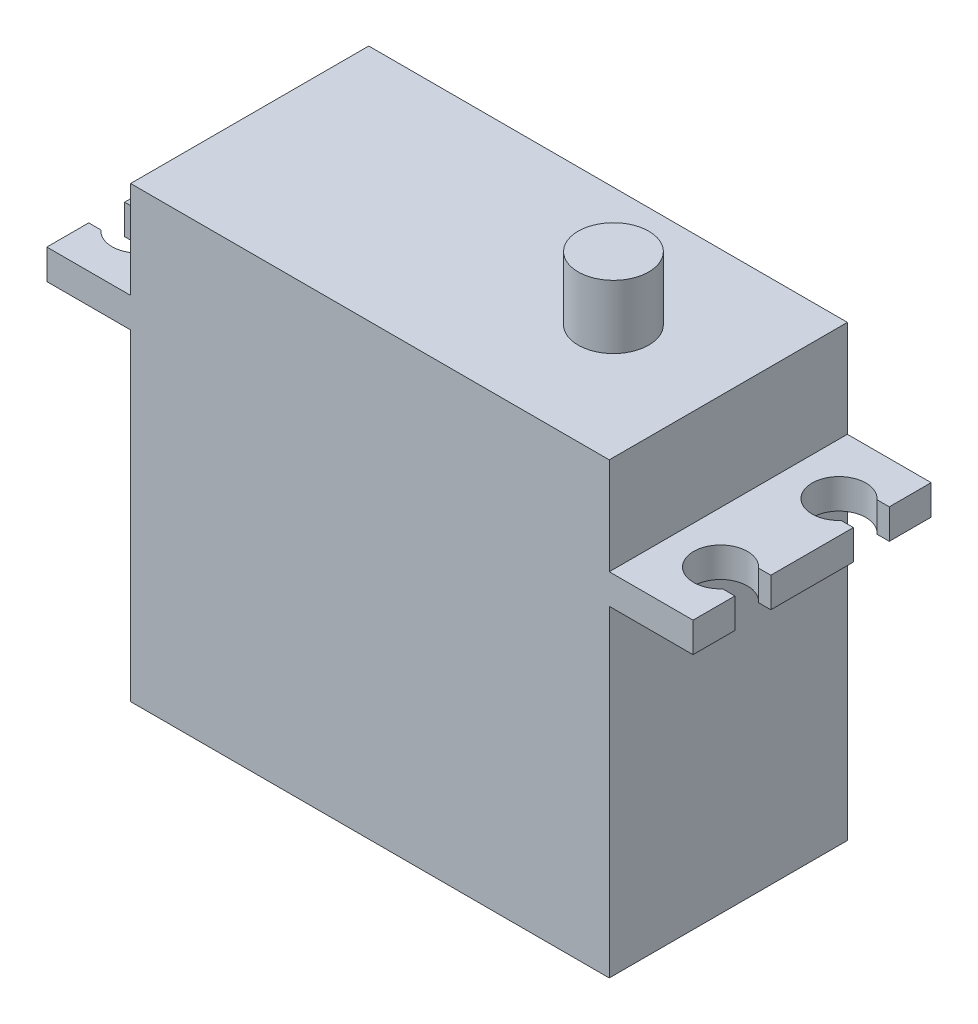
ISO-10303-21;
HEADER;
FILE_DESCRIPTION(('STEP AP214'),'2;1');
FILE_NAME('part.step','',(''),(''),'','','');
FILE_SCHEMA(('AUTOMOTIVE_DESIGN { 1 0 10303 214 1 1 1 1 }'));
ENDSEC;
DATA;
#1=APPLICATION_CONTEXT('core data for automotive mechanical design processes');
#2=APPLICATION_PROTOCOL_DEFINITION('international standard','automotive_design',2000,#1);
#3=PRODUCT_CONTEXT('',#1,'mechanical');
#4=PRODUCT('Part','Part','',(#3));
#5=PRODUCT_RELATED_PRODUCT_CATEGORY('part','',(#4));
#6=PRODUCT_DEFINITION_FORMATION('','',#4);
#7=PRODUCT_DEFINITION_CONTEXT('part definition',#1,'design');
#8=PRODUCT_DEFINITION('design','',#6,#7);
#9=PRODUCT_DEFINITION_SHAPE('','',#8);
#10=(LENGTH_UNIT() NAMED_UNIT(*) SI_UNIT(.MILLI.,.METRE.));
#11=(NAMED_UNIT(*) PLANE_ANGLE_UNIT() SI_UNIT($,.RADIAN.));
#12=(NAMED_UNIT(*) SI_UNIT($,.STERADIAN.) SOLID_ANGLE_UNIT());
#13=UNCERTAINTY_MEASURE_WITH_UNIT(LENGTH_MEASURE(1.E-05),#10,'distance_accuracy_value','');
#14=(GEOMETRIC_REPRESENTATION_CONTEXT(3) GLOBAL_UNCERTAINTY_ASSIGNED_CONTEXT((#13)) GLOBAL_UNIT_ASSIGNED_CONTEXT((#10,
#11,#12)) REPRESENTATION_CONTEXT('',''));
#15=CARTESIAN_POINT('',(0.,0.,0.));
#16=DIRECTION('',(0.,0.,1.));
#17=DIRECTION('',(1.,0.,0.));
#18=AXIS2_PLACEMENT_3D('',#15,#16,#17);
#19=CARTESIAN_POINT('',(10.4,42.8,0.));
#20=DIRECTION('',(0.,-1.,0.));
#21=DIRECTION('',(1.,0.,0.));
#22=AXIS2_PLACEMENT_3D('',#19,#20,#21);
#23=PLANE('',#22);
#24=CARTESIAN_POINT('',(10.4,42.8,0.));
#25=DIRECTION('',(0.,1.,0.));
#26=DIRECTION('',(-1.,0.,0.));
#27=AXIS2_PLACEMENT_3D('',#24,#25,#26);
#28=CIRCLE('',#27,2.95);
#29=CARTESIAN_POINT('',(7.45,42.8,0.));
#30=VERTEX_POINT('',#29);
#31=EDGE_CURVE('E11',#30,#30,#28,.T.);
#32=ORIENTED_EDGE('',*,*,#31,.T.);
#33=EDGE_LOOP('',(#32));
#34=FACE_BOUND('',#33,.T.);
#35=ADVANCED_FACE('F50',(#34),#23,.F.);
#36=CARTESIAN_POINT('',(10.4,42.8,0.));
#37=DIRECTION('',(0.,1.,0.));
#38=DIRECTION('',(-1.,0.,0.));
#39=AXIS2_PLACEMENT_3D('',#36,#37,#38);
#40=CYLINDRICAL_SURFACE('',#39,2.95);
#41=ORIENTED_EDGE('',*,*,#31,.F.);
#42=EDGE_LOOP('',(#41));
#43=FACE_BOUND('',#42,.T.);
#44=CARTESIAN_POINT('',(10.4,25.,0.));
#45=DIRECTION('',(0.,1.,0.));
#46=DIRECTION('',(-1.,0.,0.));
#47=AXIS2_PLACEMENT_3D('',#44,#45,#46);
#48=CIRCLE('',#47,2.95);
#49=CARTESIAN_POINT('',(7.45,25.,0.));
#50=VERTEX_POINT('',#49);
#51=EDGE_CURVE('E56',#50,#50,#48,.T.);
#52=ORIENTED_EDGE('',*,*,#51,.T.);
#53=EDGE_LOOP('',(#52));
#54=FACE_BOUND('',#53,.T.);
#55=ADVANCED_FACE('F82',(#43,#54),#40,.T.);
#56=CARTESIAN_POINT('',(13.35,25.,0.));
#57=DIRECTION('',(0.,-1.,0.));
#58=DIRECTION('',(1.,0.,0.));
#59=AXIS2_PLACEMENT_3D('',#56,#57,#58);
#60=PLANE('',#59);
#61=ORIENTED_EDGE('',*,*,#51,.F.);
#62=EDGE_LOOP('',(#61));
#63=FACE_BOUND('',#62,.T.);
#64=CARTESIAN_POINT('',(10.4,25.,0.));
#65=DIRECTION('',(0.,1.,0.));
#66=DIRECTION('',(-1.,0.,0.));
#67=AXIS2_PLACEMENT_3D('',#64,#65,#66);
#68=CIRCLE('',#67,6.);
#69=CARTESIAN_POINT('',(4.4,25.,0.));
#70=VERTEX_POINT('',#69);
#71=EDGE_CURVE('E60',#70,#70,#68,.T.);
#72=ORIENTED_EDGE('',*,*,#71,.T.);
#73=EDGE_LOOP('',(#72));
#74=FACE_BOUND('',#73,.T.);
#75=ADVANCED_FACE('F78',(#63,#74),#60,.F.);
#76=CARTESIAN_POINT('',(10.4,42.8,0.));
#77=DIRECTION('',(0.,1.,0.));
#78=DIRECTION('',(-1.,0.,0.));
#79=AXIS2_PLACEMENT_3D('',#76,#77,#78);
#80=CYLINDRICAL_SURFACE('',#79,6.);
#81=ORIENTED_EDGE('',*,*,#71,.F.);
#82=EDGE_LOOP('',(#81));
#83=FACE_BOUND('',#82,.T.);
#84=CARTESIAN_POINT('',(10.4,3.,0.));
#85=DIRECTION('',(0.,1.,0.));
#86=DIRECTION('',(-1.,0.,0.));
#87=AXIS2_PLACEMENT_3D('',#84,#85,#86);
#88=CIRCLE('',#87,6.);
#89=CARTESIAN_POINT('',(4.4,3.,0.));
#90=VERTEX_POINT('',#89);
#91=EDGE_CURVE('E64',#90,#90,#88,.T.);
#92=ORIENTED_EDGE('',*,*,#91,.T.);
#93=EDGE_LOOP('',(#92));
#94=FACE_BOUND('',#93,.T.);
#95=ADVANCED_FACE('F70',(#83,#94),#80,.T.);
#96=CARTESIAN_POINT('',(16.4,3.,0.));
#97=DIRECTION('',(0.,1.,0.));
#98=DIRECTION('',(-1.,0.,0.));
#99=AXIS2_PLACEMENT_3D('',#96,#97,#98);
#100=PLANE('',#99);
#101=ORIENTED_EDGE('',*,*,#91,.F.);
#102=EDGE_LOOP('',(#101));
#103=FACE_BOUND('',#102,.T.);
#104=ADVANCED_FACE('F72',(#103),#100,.F.);
#105=CLOSED_SHELL('',(#35,#55,#75,#95,#104));
#106=MANIFOLD_SOLID_BREP('B2',#105);
#107=CARTESIAN_POINT('',(-24.3,29.4,-4.95));
#108=DIRECTION('',(0.,1.,0.));
#109=DIRECTION('',(0.,0.,1.));
#110=AXIS2_PLACEMENT_3D('',#107,#108,#109);
#111=PLANE('',#110);
#112=DIRECTION('',(0.,0.,-1.));
#113=VECTOR('',#112,1.);
#114=CARTESIAN_POINT('',(20.,29.4,9.95));
#115=LINE('',#114,#113);
#116=CARTESIAN_POINT('',(20.,29.4,9.95));
#117=VERTEX_POINT('',#116);
#118=CARTESIAN_POINT('',(20.,29.4,-9.95));
#119=VERTEX_POINT('',#118);
#120=EDGE_CURVE('E126',#117,#119,#115,.T.);
#121=ORIENTED_EDGE('',*,*,#120,.F.);
#122=DIRECTION('',(1.,0.,0.));
#123=VECTOR('',#122,1.);
#124=CARTESIAN_POINT('',(-27.,29.4,9.95));
#125=LINE('',#124,#123);
#126=CARTESIAN_POINT('',(27.,29.4,9.95));
#127=VERTEX_POINT('',#126);
#128=EDGE_CURVE('E351',#117,#127,#125,.T.);
#129=ORIENTED_EDGE('',*,*,#128,.T.);
#130=DIRECTION('',(0.,0.,-1.));
#131=VECTOR('',#130,1.);
#132=CARTESIAN_POINT('',(27.,29.4,9.95));
#133=LINE('',#132,#131);
#134=CARTESIAN_POINT('',(27.,29.4,6.45));
#135=VERTEX_POINT('',#134);
#136=EDGE_CURVE('E354',#127,#135,#133,.T.);
#137=ORIENTED_EDGE('',*,*,#136,.T.);
#138=DIRECTION('',(-1.,0.,0.));
#139=VECTOR('',#138,1.);
#140=CARTESIAN_POINT('',(25.9770509831248,29.4,6.45));
#141=LINE('',#140,#139);
#142=CARTESIAN_POINT('',(25.9770509831248,29.4,6.45));
#143=VERTEX_POINT('',#142);
#144=EDGE_CURVE('E356',#135,#143,#141,.T.);
#145=ORIENTED_EDGE('',*,*,#144,.T.);
#146=CARTESIAN_POINT('',(24.3,29.4,4.95));
#147=DIRECTION('',(0.,-1.,0.));
#148=DIRECTION('',(0.,0.,1.));
#149=AXIS2_PLACEMENT_3D('',#146,#147,#148);
#150=CIRCLE('',#149,2.25);
#151=CARTESIAN_POINT('',(25.9770509831248,29.4,3.45));
#152=VERTEX_POINT('',#151);
#153=EDGE_CURVE('E358',#143,#152,#150,.T.);
#154=ORIENTED_EDGE('',*,*,#153,.T.);
#155=DIRECTION('',(1.,0.,0.));
#156=VECTOR('',#155,1.);
#157=CARTESIAN_POINT('',(25.9770509831248,29.4,3.45));
#158=LINE('',#157,#156);
#159=CARTESIAN_POINT('',(27.,29.4,3.45));
#160=VERTEX_POINT('',#159);
#161=EDGE_CURVE('E360',#152,#160,#158,.T.);
#162=ORIENTED_EDGE('',*,*,#161,.T.);
#163=DIRECTION('',(0.,0.,-1.));
#164=VECTOR('',#163,1.);
#165=CARTESIAN_POINT('',(27.,29.4,3.45));
#166=LINE('',#165,#164);
#167=CARTESIAN_POINT('',(27.,29.4,-3.45));
#168=VERTEX_POINT('',#167);
#169=EDGE_CURVE('E362',#160,#168,#166,.T.);
#170=ORIENTED_EDGE('',*,*,#169,.T.);
#171=DIRECTION('',(-1.,0.,0.));
#172=VECTOR('',#171,1.);
#173=CARTESIAN_POINT('',(25.9770509831248,29.4,-3.45));
#174=LINE('',#173,#172);
#175=CARTESIAN_POINT('',(25.9770509831248,29.4,-3.45));
#176=VERTEX_POINT('',#175);
#177=EDGE_CURVE('E364',#168,#176,#174,.T.);
#178=ORIENTED_EDGE('',*,*,#177,.T.);
#179=CARTESIAN_POINT('',(24.3,29.4,-4.95));
#180=DIRECTION('',(0.,-1.,0.));
#181=DIRECTION('',(0.,0.,1.));
#182=AXIS2_PLACEMENT_3D('',#179,#180,#181);
#183=CIRCLE('',#182,2.25);
#184=CARTESIAN_POINT('',(25.9770509831248,29.4,-6.45));
#185=VERTEX_POINT('',#184);
#186=EDGE_CURVE('E366',#176,#185,#183,.T.);
#187=ORIENTED_EDGE('',*,*,#186,.T.);
#188=DIRECTION('',(1.,0.,0.));
#189=VECTOR('',#188,1.);
#190=CARTESIAN_POINT('',(25.9770509831248,29.4,-6.45));
#191=LINE('',#190,#189);
#192=CARTESIAN_POINT('',(27.,29.4,-6.45));
#193=VERTEX_POINT('',#192);
#194=EDGE_CURVE('E368',#185,#193,#191,.T.);
#195=ORIENTED_EDGE('',*,*,#194,.T.);
#196=DIRECTION('',(0.,0.,-1.));
#197=VECTOR('',#196,1.);
#198=CARTESIAN_POINT('',(27.,29.4,-6.45));
#199=LINE('',#198,#197);
#200=CARTESIAN_POINT('',(27.,29.4,-9.95));
#201=VERTEX_POINT('',#200);
#202=EDGE_CURVE('E326',#193,#201,#199,.T.);
#203=ORIENTED_EDGE('',*,*,#202,.T.);
#204=DIRECTION('',(-1.,0.,0.));
#205=VECTOR('',#204,1.);
#206=CARTESIAN_POINT('',(-27.,29.4,-9.95));
#207=LINE('',#206,#205);
#208=EDGE_CURVE('E331',#201,#119,#207,.T.);
#209=ORIENTED_EDGE('',*,*,#208,.T.);
#210=EDGE_LOOP('',(#121,#129,#137,#145,#154,#162,#170,#178,#187,#195,#203,#209));
#211=FACE_BOUND('',#210,.T.);
#212=ADVANCED_FACE('F110',(#211),#111,.T.);
#213=CARTESIAN_POINT('',(20.,26.9,9.95));
#214=DIRECTION('',(-1.,0.,0.));
#215=DIRECTION('',(0.,0.,1.));
#216=AXIS2_PLACEMENT_3D('',#213,#214,#215);
#217=PLANE('',#216);
#218=DIRECTION('',(0.,0.,-1.));
#219=VECTOR('',#218,1.);
#220=CARTESIAN_POINT('',(20.,0.,9.95));
#221=LINE('',#220,#219);
#222=CARTESIAN_POINT('',(20.,0.,9.95));
#223=VERTEX_POINT('',#222);
#224=CARTESIAN_POINT('',(20.,0.,-9.95));
#225=VERTEX_POINT('',#224);
#226=EDGE_CURVE('E470',#223,#225,#221,.T.);
#227=ORIENTED_EDGE('',*,*,#226,.T.);
#228=DIRECTION('',(0.,-1.,0.));
#229=VECTOR('',#228,1.);
#230=CARTESIAN_POINT('',(20.,26.9,-9.95));
#231=LINE('',#230,#229);
#232=CARTESIAN_POINT('',(20.,26.9,-9.95));
#233=VERTEX_POINT('',#232);
#234=EDGE_CURVE('E48',#233,#225,#231,.T.);
#235=ORIENTED_EDGE('',*,*,#234,.F.);
#236=DIRECTION('',(0.,0.,-1.));
#237=VECTOR('',#236,1.);
#238=CARTESIAN_POINT('',(20.,26.9,9.95));
#239=LINE('',#238,#237);
#240=CARTESIAN_POINT('',(20.,26.9,9.95));
#241=VERTEX_POINT('',#240);
#242=EDGE_CURVE('E471',#241,#233,#239,.T.);
#243=ORIENTED_EDGE('',*,*,#242,.F.);
#244=DIRECTION('',(0.,-1.,0.));
#245=VECTOR('',#244,1.);
#246=CARTESIAN_POINT('',(20.,26.9,9.95));
#247=LINE('',#246,#245);
#248=EDGE_CURVE('E478',#241,#223,#247,.T.);
#249=ORIENTED_EDGE('',*,*,#248,.T.);
#250=EDGE_LOOP('',(#227,#235,#243,#249));
#251=FACE_BOUND('',#250,.T.);
#252=ADVANCED_FACE('F112',(#251),#217,.F.);
#253=CARTESIAN_POINT('',(-20.,26.9,-9.95));
#254=DIRECTION('',(0.,0.,1.));
#255=DIRECTION('',(1.,0.,0.));
#256=AXIS2_PLACEMENT_3D('',#253,#254,#255);
#257=PLANE('',#256);
#258=DIRECTION('',(-1.,0.,0.));
#259=VECTOR('',#258,1.);
#260=CARTESIAN_POINT('',(-20.,0.,-9.95));
#261=LINE('',#260,#259);
#262=CARTESIAN_POINT('',(-20.,0.,-9.95));
#263=VERTEX_POINT('',#262);
#264=EDGE_CURVE('E481',#225,#263,#261,.T.);
#265=ORIENTED_EDGE('',*,*,#264,.T.);
#266=DIRECTION('',(0.,-1.,0.));
#267=VECTOR('',#266,1.);
#268=CARTESIAN_POINT('',(-20.,26.9,-9.95));
#269=LINE('',#268,#267);
#270=CARTESIAN_POINT('',(-20.,26.9,-9.95));
#271=VERTEX_POINT('',#270);
#272=EDGE_CURVE('E119',#271,#263,#269,.T.);
#273=ORIENTED_EDGE('',*,*,#272,.F.);
#274=DIRECTION('',(-1.,0.,0.));
#275=VECTOR('',#274,1.);
#276=CARTESIAN_POINT('',(-27.,26.9,-9.95));
#277=LINE('',#276,#275);
#278=CARTESIAN_POINT('',(-27.,26.9,-9.95));
#279=VERTEX_POINT('',#278);
#280=EDGE_CURVE('E320',#271,#279,#277,.T.);
#281=ORIENTED_EDGE('',*,*,#280,.T.);
#282=DIRECTION('',(0.,-1.,0.));
#283=VECTOR('',#282,1.);
#284=CARTESIAN_POINT('',(-27.,29.4,-9.95));
#285=LINE('',#284,#283);
#286=CARTESIAN_POINT('',(-27.,29.4,-9.95));
#287=VERTEX_POINT('',#286);
#288=EDGE_CURVE('E464',#287,#279,#285,.T.);
#289=ORIENTED_EDGE('',*,*,#288,.F.);
#290=CARTESIAN_POINT('',(-20.,29.4,-9.95));
#291=VERTEX_POINT('',#290);
#292=EDGE_CURVE('E329',#291,#287,#207,.T.);
#293=ORIENTED_EDGE('',*,*,#292,.F.);
#294=DIRECTION('',(0.,-1.,0.));
#295=VECTOR('',#294,1.);
#296=CARTESIAN_POINT('',(-20.,37.5,-9.95));
#297=LINE('',#296,#295);
#298=CARTESIAN_POINT('',(-20.,37.5,-9.95));
#299=VERTEX_POINT('',#298);
#300=EDGE_CURVE('E302',#299,#291,#297,.T.);
#301=ORIENTED_EDGE('',*,*,#300,.F.);
#302=DIRECTION('',(-1.,0.,0.));
#303=VECTOR('',#302,1.);
#304=CARTESIAN_POINT('',(-20.,37.5,-9.95));
#305=LINE('',#304,#303);
#306=CARTESIAN_POINT('',(20.,37.5,-9.95));
#307=VERTEX_POINT('',#306);
#308=EDGE_CURVE('E296',#307,#299,#305,.T.);
#309=ORIENTED_EDGE('',*,*,#308,.F.);
#310=DIRECTION('',(0.,-1.,0.));
#311=VECTOR('',#310,1.);
#312=CARTESIAN_POINT('',(20.,37.5,-9.95));
#313=LINE('',#312,#311);
#314=EDGE_CURVE('E300',#307,#119,#313,.T.);
#315=ORIENTED_EDGE('',*,*,#314,.T.);
#316=ORIENTED_EDGE('',*,*,#208,.F.);
#317=DIRECTION('',(0.,-1.,0.));
#318=VECTOR('',#317,1.);
#319=CARTESIAN_POINT('',(27.,29.4,-9.95));
#320=LINE('',#319,#318);
#321=CARTESIAN_POINT('',(27.,26.9,-9.95));
#322=VERTEX_POINT('',#321);
#323=EDGE_CURVE('E467',#201,#322,#320,.T.);
#324=ORIENTED_EDGE('',*,*,#323,.T.);
#325=EDGE_CURVE('E371',#322,#233,#277,.T.);
#326=ORIENTED_EDGE('',*,*,#325,.T.);
#327=ORIENTED_EDGE('',*,*,#234,.T.);
#328=EDGE_LOOP('',(#265,#273,#281,#289,#293,#301,#309,#315,#316,#324,#326,#327));
#329=FACE_BOUND('',#328,.T.);
#330=ADVANCED_FACE('F298',(#329),#257,.F.);
#331=CARTESIAN_POINT('',(-20.,26.9,9.95));
#332=DIRECTION('',(1.,0.,0.));
#333=DIRECTION('',(0.,0.,-1.));
#334=AXIS2_PLACEMENT_3D('',#331,#332,#333);
#335=PLANE('',#334);
#336=DIRECTION('',(0.,0.,1.));
#337=VECTOR('',#336,1.);
#338=CARTESIAN_POINT('',(-20.,0.,9.95));
#339=LINE('',#338,#337);
#340=CARTESIAN_POINT('',(-20.,0.,9.95));
#341=VERTEX_POINT('',#340);
#342=EDGE_CURVE('E483',#263,#341,#339,.T.);
#343=ORIENTED_EDGE('',*,*,#342,.T.);
#344=DIRECTION('',(0.,-1.,0.));
#345=VECTOR('',#344,1.);
#346=CARTESIAN_POINT('',(-20.,26.9,9.95));
#347=LINE('',#346,#345);
#348=CARTESIAN_POINT('',(-20.,26.9,9.95));
#349=VERTEX_POINT('',#348);
#350=EDGE_CURVE('E488',#349,#341,#347,.T.);
#351=ORIENTED_EDGE('',*,*,#350,.F.);
#352=DIRECTION('',(0.,0.,1.));
#353=VECTOR('',#352,1.);
#354=CARTESIAN_POINT('',(-20.,26.9,9.95));
#355=LINE('',#354,#353);
#356=EDGE_CURVE('E474',#271,#349,#355,.T.);
#357=ORIENTED_EDGE('',*,*,#356,.F.);
#358=ORIENTED_EDGE('',*,*,#272,.T.);
#359=EDGE_LOOP('',(#343,#351,#357,#358));
#360=FACE_BOUND('',#359,.T.);
#361=ADVANCED_FACE('F495',(#360),#335,.F.);
#362=CARTESIAN_POINT('',(-20.,26.9,9.95));
#363=DIRECTION('',(0.,0.,-1.));
#364=DIRECTION('',(-1.,0.,0.));
#365=AXIS2_PLACEMENT_3D('',#362,#363,#364);
#366=PLANE('',#365);
#367=DIRECTION('',(1.,0.,0.));
#368=VECTOR('',#367,1.);
#369=CARTESIAN_POINT('',(-20.,0.,9.95));
#370=LINE('',#369,#368);
#371=EDGE_CURVE('E475',#341,#223,#370,.T.);
#372=ORIENTED_EDGE('',*,*,#371,.T.);
#373=ORIENTED_EDGE('',*,*,#248,.F.);
#374=DIRECTION('',(1.,0.,0.));
#375=VECTOR('',#374,1.);
#376=CARTESIAN_POINT('',(-27.,26.9,9.95));
#377=LINE('',#376,#375);
#378=CARTESIAN_POINT('',(27.,26.9,9.95));
#379=VERTEX_POINT('',#378);
#380=EDGE_CURVE('E392',#241,#379,#377,.T.);
#381=ORIENTED_EDGE('',*,*,#380,.T.);
#382=DIRECTION('',(0.,-1.,0.));
#383=VECTOR('',#382,1.);
#384=CARTESIAN_POINT('',(27.,29.4,9.95));
#385=LINE('',#384,#383);
#386=EDGE_CURVE('E434',#127,#379,#385,.T.);
#387=ORIENTED_EDGE('',*,*,#386,.F.);
#388=ORIENTED_EDGE('',*,*,#128,.F.);
#389=DIRECTION('',(0.,-1.,0.));
#390=VECTOR('',#389,1.);
#391=CARTESIAN_POINT('',(20.,37.5,9.95));
#392=LINE('',#391,#390);
#393=CARTESIAN_POINT('',(20.,37.5,9.95));
#394=VERTEX_POINT('',#393);
#395=EDGE_CURVE('E517',#394,#117,#392,.T.);
#396=ORIENTED_EDGE('',*,*,#395,.F.);
#397=DIRECTION('',(1.,0.,0.));
#398=VECTOR('',#397,1.);
#399=CARTESIAN_POINT('',(-20.,37.5,9.95));
#400=LINE('',#399,#398);
#401=CARTESIAN_POINT('',(-20.,37.5,9.95));
#402=VERTEX_POINT('',#401);
#403=EDGE_CURVE('E311',#402,#394,#400,.T.);
#404=ORIENTED_EDGE('',*,*,#403,.F.);
#405=DIRECTION('',(0.,-1.,0.));
#406=VECTOR('',#405,1.);
#407=CARTESIAN_POINT('',(-20.,37.5,9.95));
#408=LINE('',#407,#406);
#409=CARTESIAN_POINT('',(-20.,29.4,9.95));
#410=VERTEX_POINT('',#409);
#411=EDGE_CURVE('E322',#402,#410,#408,.T.);
#412=ORIENTED_EDGE('',*,*,#411,.T.);
#413=CARTESIAN_POINT('',(-27.,29.4,9.95));
#414=VERTEX_POINT('',#413);
#415=EDGE_CURVE('E352',#414,#410,#125,.T.);
#416=ORIENTED_EDGE('',*,*,#415,.F.);
#417=DIRECTION('',(0.,-1.,0.));
#418=VECTOR('',#417,1.);
#419=CARTESIAN_POINT('',(-27.,29.4,9.95));
#420=LINE('',#419,#418);
#421=CARTESIAN_POINT('',(-27.,26.9,9.95));
#422=VERTEX_POINT('',#421);
#423=EDGE_CURVE('E437',#414,#422,#420,.T.);
#424=ORIENTED_EDGE('',*,*,#423,.T.);
#425=EDGE_CURVE('E393',#422,#349,#377,.T.);
#426=ORIENTED_EDGE('',*,*,#425,.T.);
#427=ORIENTED_EDGE('',*,*,#350,.T.);
#428=EDGE_LOOP('',(#372,#373,#381,#387,#388,#396,#404,#412,#416,#424,#426,#427));
#429=FACE_BOUND('',#428,.T.);
#430=ADVANCED_FACE('F502',(#429),#366,.F.);
#431=CARTESIAN_POINT('',(0.,0.,0.));
#432=DIRECTION('',(0.,-1.,0.));
#433=DIRECTION('',(0.,0.,-1.));
#434=AXIS2_PLACEMENT_3D('',#431,#432,#433);
#435=PLANE('',#434);
#436=ORIENTED_EDGE('',*,*,#226,.F.);
#437=ORIENTED_EDGE('',*,*,#371,.F.);
#438=ORIENTED_EDGE('',*,*,#342,.F.);
#439=ORIENTED_EDGE('',*,*,#264,.F.);
#440=EDGE_LOOP('',(#436,#437,#438,#439));
#441=FACE_BOUND('',#440,.T.);
#442=ADVANCED_FACE('F500',(#441),#435,.T.);
#443=CARTESIAN_POINT('',(-24.3,26.9,-4.95));
#444=DIRECTION('',(0.,1.,0.));
#445=DIRECTION('',(0.,0.,1.));
#446=AXIS2_PLACEMENT_3D('',#443,#444,#445);
#447=PLANE('',#446);
#448=ORIENTED_EDGE('',*,*,#380,.F.);
#449=ORIENTED_EDGE('',*,*,#242,.T.);
#450=ORIENTED_EDGE('',*,*,#325,.F.);
#451=DIRECTION('',(0.,0.,-1.));
#452=VECTOR('',#451,1.);
#453=CARTESIAN_POINT('',(27.,26.9,-6.45));
#454=LINE('',#453,#452);
#455=CARTESIAN_POINT('',(27.,26.9,-6.45));
#456=VERTEX_POINT('',#455);
#457=EDGE_CURVE('E317',#456,#322,#454,.T.);
#458=ORIENTED_EDGE('',*,*,#457,.F.);
#459=DIRECTION('',(1.,0.,0.));
#460=VECTOR('',#459,1.);
#461=CARTESIAN_POINT('',(25.9770509831248,26.9,-6.45));
#462=LINE('',#461,#460);
#463=CARTESIAN_POINT('',(25.9770509831248,26.9,-6.45));
#464=VERTEX_POINT('',#463);
#465=EDGE_CURVE('E330',#464,#456,#462,.T.);
#466=ORIENTED_EDGE('',*,*,#465,.F.);
#467=CARTESIAN_POINT('',(24.3,26.9,-4.95));
#468=DIRECTION('',(0.,-1.,0.));
#469=DIRECTION('',(0.,0.,1.));
#470=AXIS2_PLACEMENT_3D('',#467,#468,#469);
#471=CIRCLE('',#470,2.25);
#472=CARTESIAN_POINT('',(25.9770509831248,26.9,-3.45));
#473=VERTEX_POINT('',#472);
#474=EDGE_CURVE('E408',#473,#464,#471,.T.);
#475=ORIENTED_EDGE('',*,*,#474,.F.);
#476=DIRECTION('',(-1.,0.,0.));
#477=VECTOR('',#476,1.);
#478=CARTESIAN_POINT('',(25.9770509831248,26.9,-3.45));
#479=LINE('',#478,#477);
#480=CARTESIAN_POINT('',(27.,26.9,-3.45));
#481=VERTEX_POINT('',#480);
#482=EDGE_CURVE('E406',#481,#473,#479,.T.);
#483=ORIENTED_EDGE('',*,*,#482,.F.);
#484=DIRECTION('',(0.,0.,-1.));
#485=VECTOR('',#484,1.);
#486=CARTESIAN_POINT('',(27.,26.9,3.45));
#487=LINE('',#486,#485);
#488=CARTESIAN_POINT('',(27.,26.9,3.45));
#489=VERTEX_POINT('',#488);
#490=EDGE_CURVE('E404',#489,#481,#487,.T.);
#491=ORIENTED_EDGE('',*,*,#490,.F.);
#492=DIRECTION('',(1.,0.,0.));
#493=VECTOR('',#492,1.);
#494=CARTESIAN_POINT('',(25.9770509831248,26.9,3.45));
#495=LINE('',#494,#493);
#496=CARTESIAN_POINT('',(25.9770509831248,26.9,3.45));
#497=VERTEX_POINT('',#496);
#498=EDGE_CURVE('E402',#497,#489,#495,.T.);
#499=ORIENTED_EDGE('',*,*,#498,.F.);
#500=CARTESIAN_POINT('',(24.3,26.9,4.95));
#501=DIRECTION('',(0.,-1.,0.));
#502=DIRECTION('',(0.,0.,1.));
#503=AXIS2_PLACEMENT_3D('',#500,#501,#502);
#504=CIRCLE('',#503,2.25);
#505=CARTESIAN_POINT('',(25.9770509831248,26.9,6.45));
#506=VERTEX_POINT('',#505);
#507=EDGE_CURVE('E400',#506,#497,#504,.T.);
#508=ORIENTED_EDGE('',*,*,#507,.F.);
#509=DIRECTION('',(-1.,0.,0.));
#510=VECTOR('',#509,1.);
#511=CARTESIAN_POINT('',(25.9770509831248,26.9,6.45));
#512=LINE('',#511,#510);
#513=CARTESIAN_POINT('',(27.,26.9,6.45));
#514=VERTEX_POINT('',#513);
#515=EDGE_CURVE('E398',#514,#506,#512,.T.);
#516=ORIENTED_EDGE('',*,*,#515,.F.);
#517=DIRECTION('',(0.,0.,-1.));
#518=VECTOR('',#517,1.);
#519=CARTESIAN_POINT('',(27.,26.9,9.95));
#520=LINE('',#519,#518);
#521=EDGE_CURVE('E396',#379,#514,#520,.T.);
#522=ORIENTED_EDGE('',*,*,#521,.F.);
#523=EDGE_LOOP('',(#448,#449,#450,#458,#466,#475,#483,#491,#499,#508,#516,#522));
#524=FACE_BOUND('',#523,.T.);
#525=ADVANCED_FACE('F508',(#524),#447,.F.);
#526=ORIENTED_EDGE('',*,*,#280,.F.);
#527=ORIENTED_EDGE('',*,*,#356,.T.);
#528=ORIENTED_EDGE('',*,*,#425,.F.);
#529=DIRECTION('',(0.,0.,1.));
#530=VECTOR('',#529,1.);
#531=CARTESIAN_POINT('',(-27.,26.9,9.95));
#532=LINE('',#531,#530);
#533=CARTESIAN_POINT('',(-27.,26.9,6.45));
#534=VERTEX_POINT('',#533);
#535=EDGE_CURVE('E390',#534,#422,#532,.T.);
#536=ORIENTED_EDGE('',*,*,#535,.F.);
#537=DIRECTION('',(-1.,0.,0.));
#538=VECTOR('',#537,1.);
#539=CARTESIAN_POINT('',(-25.9770509831249,26.9,6.45));
#540=LINE('',#539,#538);
#541=CARTESIAN_POINT('',(-25.9770509831249,26.9,6.45));
#542=VERTEX_POINT('',#541);
#543=EDGE_CURVE('E388',#542,#534,#540,.T.);
#544=ORIENTED_EDGE('',*,*,#543,.F.);
#545=CARTESIAN_POINT('',(-24.3,26.9,4.95));
#546=DIRECTION('',(0.,-1.,0.));
#547=DIRECTION('',(0.,0.,1.));
#548=AXIS2_PLACEMENT_3D('',#545,#546,#547);
#549=CIRCLE('',#548,2.25);
#550=CARTESIAN_POINT('',(-25.9770509831249,26.9,3.45));
#551=VERTEX_POINT('',#550);
#552=EDGE_CURVE('E386',#551,#542,#549,.T.);
#553=ORIENTED_EDGE('',*,*,#552,.F.);
#554=DIRECTION('',(1.,0.,0.));
#555=VECTOR('',#554,1.);
#556=CARTESIAN_POINT('',(-25.9770509831249,26.9,3.45));
#557=LINE('',#556,#555);
#558=CARTESIAN_POINT('',(-27.,26.9,3.45));
#559=VERTEX_POINT('',#558);
#560=EDGE_CURVE('E384',#559,#551,#557,.T.);
#561=ORIENTED_EDGE('',*,*,#560,.F.);
#562=DIRECTION('',(0.,0.,1.));
#563=VECTOR('',#562,1.);
#564=CARTESIAN_POINT('',(-27.,26.9,3.45));
#565=LINE('',#564,#563);
#566=CARTESIAN_POINT('',(-27.,26.9,-3.45000000000001));
#567=VERTEX_POINT('',#566);
#568=EDGE_CURVE('E382',#567,#559,#565,.T.);
#569=ORIENTED_EDGE('',*,*,#568,.F.);
#570=DIRECTION('',(-1.,0.,0.));
#571=VECTOR('',#570,1.);
#572=CARTESIAN_POINT('',(-25.9770509831249,26.9,-3.45000000000001));
#573=LINE('',#572,#571);
#574=CARTESIAN_POINT('',(-25.9770509831249,26.9,-3.45000000000001));
#575=VERTEX_POINT('',#574);
#576=EDGE_CURVE('E380',#575,#567,#573,.T.);
#577=ORIENTED_EDGE('',*,*,#576,.F.);
#578=CARTESIAN_POINT('',(-24.3,26.9,-4.95));
#579=DIRECTION('',(0.,-1.,0.));
#580=DIRECTION('',(0.,0.,1.));
#581=AXIS2_PLACEMENT_3D('',#578,#579,#580);
#582=CIRCLE('',#581,2.25);
#583=CARTESIAN_POINT('',(-25.9770509831249,26.9,-6.45));
#584=VERTEX_POINT('',#583);
#585=EDGE_CURVE('E378',#584,#575,#582,.T.);
#586=ORIENTED_EDGE('',*,*,#585,.F.);
#587=DIRECTION('',(1.,0.,0.));
#588=VECTOR('',#587,1.);
#589=CARTESIAN_POINT('',(-25.9770509831249,26.9,-6.45));
#590=LINE('',#589,#588);
#591=CARTESIAN_POINT('',(-27.,26.9,-6.45));
#592=VERTEX_POINT('',#591);
#593=EDGE_CURVE('E376',#592,#584,#590,.T.);
#594=ORIENTED_EDGE('',*,*,#593,.F.);
#595=DIRECTION('',(0.,0.,1.));
#596=VECTOR('',#595,1.);
#597=CARTESIAN_POINT('',(-27.,26.9,-6.45));
#598=LINE('',#597,#596);
#599=EDGE_CURVE('E374',#279,#592,#598,.T.);
#600=ORIENTED_EDGE('',*,*,#599,.F.);
#601=EDGE_LOOP('',(#526,#527,#528,#536,#544,#553,#561,#569,#577,#586,#594,#600));
#602=FACE_BOUND('',#601,.T.);
#603=ADVANCED_FACE('F637',(#602),#447,.F.);
#604=CARTESIAN_POINT('',(27.,29.4,-6.45));
#605=DIRECTION('',(-1.,0.,0.));
#606=DIRECTION('',(0.,0.,1.));
#607=AXIS2_PLACEMENT_3D('',#604,#605,#606);
#608=PLANE('',#607);
#609=ORIENTED_EDGE('',*,*,#457,.T.);
#610=ORIENTED_EDGE('',*,*,#323,.F.);
#611=ORIENTED_EDGE('',*,*,#202,.F.);
#612=DIRECTION('',(0.,-1.,0.));
#613=VECTOR('',#612,1.);
#614=CARTESIAN_POINT('',(27.,29.4,-6.45));
#615=LINE('',#614,#613);
#616=EDGE_CURVE('E369',#193,#456,#615,.T.);
#617=ORIENTED_EDGE('',*,*,#616,.T.);
#618=EDGE_LOOP('',(#609,#610,#611,#617));
#619=FACE_BOUND('',#618,.T.);
#620=ADVANCED_FACE('F633',(#619),#608,.F.);
#621=CARTESIAN_POINT('',(-27.,29.4,-6.45));
#622=DIRECTION('',(1.,0.,0.));
#623=DIRECTION('',(0.,0.,-1.));
#624=AXIS2_PLACEMENT_3D('',#621,#622,#623);
#625=PLANE('',#624);
#626=ORIENTED_EDGE('',*,*,#599,.T.);
#627=DIRECTION('',(0.,-1.,0.));
#628=VECTOR('',#627,1.);
#629=CARTESIAN_POINT('',(-27.,29.4,-6.45));
#630=LINE('',#629,#628);
#631=CARTESIAN_POINT('',(-27.,29.4,-6.45));
#632=VERTEX_POINT('',#631);
#633=EDGE_CURVE('E461',#632,#592,#630,.T.);
#634=ORIENTED_EDGE('',*,*,#633,.F.);
#635=DIRECTION('',(0.,0.,1.));
#636=VECTOR('',#635,1.);
#637=CARTESIAN_POINT('',(-27.,29.4,-6.45));
#638=LINE('',#637,#636);
#639=EDGE_CURVE('E333',#287,#632,#638,.T.);
#640=ORIENTED_EDGE('',*,*,#639,.F.);
#641=ORIENTED_EDGE('',*,*,#288,.T.);
#642=EDGE_LOOP('',(#626,#634,#640,#641));
#643=FACE_BOUND('',#642,.T.);
#644=ADVANCED_FACE('F629',(#643),#625,.F.);
#645=CARTESIAN_POINT('',(-25.9770509831249,29.4,-6.45));
#646=DIRECTION('',(0.,0.,-1.));
#647=DIRECTION('',(-1.,0.,0.));
#648=AXIS2_PLACEMENT_3D('',#645,#646,#647);
#649=PLANE('',#648);
#650=ORIENTED_EDGE('',*,*,#593,.T.);
#651=DIRECTION('',(0.,-1.,0.));
#652=VECTOR('',#651,1.);
#653=CARTESIAN_POINT('',(-25.9770509831249,29.4,-6.45));
#654=LINE('',#653,#652);
#655=CARTESIAN_POINT('',(-25.9770509831249,29.4,-6.45));
#656=VERTEX_POINT('',#655);
#657=EDGE_CURVE('E458',#656,#584,#654,.T.);
#658=ORIENTED_EDGE('',*,*,#657,.F.);
#659=DIRECTION('',(1.,0.,0.));
#660=VECTOR('',#659,1.);
#661=CARTESIAN_POINT('',(-25.9770509831249,29.4,-6.45));
#662=LINE('',#661,#660);
#663=EDGE_CURVE('E335',#632,#656,#662,.T.);
#664=ORIENTED_EDGE('',*,*,#663,.F.);
#665=ORIENTED_EDGE('',*,*,#633,.T.);
#666=EDGE_LOOP('',(#650,#658,#664,#665));
#667=FACE_BOUND('',#666,.T.);
#668=ADVANCED_FACE('F625',(#667),#649,.F.);
#669=CARTESIAN_POINT('',(-24.3,29.4,-4.95));
#670=DIRECTION('',(0.,-1.,0.));
#671=DIRECTION('',(0.,0.,-1.));
#672=AXIS2_PLACEMENT_3D('',#669,#670,#671);
#673=CYLINDRICAL_SURFACE('',#672,2.25);
#674=ORIENTED_EDGE('',*,*,#585,.T.);
#675=DIRECTION('',(0.,-1.,0.));
#676=VECTOR('',#675,1.);
#677=CARTESIAN_POINT('',(-25.9770509831249,29.4,-3.45000000000001));
#678=LINE('',#677,#676);
#679=CARTESIAN_POINT('',(-25.9770509831249,29.4,-3.45000000000001));
#680=VERTEX_POINT('',#679);
#681=EDGE_CURVE('E455',#680,#575,#678,.T.);
#682=ORIENTED_EDGE('',*,*,#681,.F.);
#683=CARTESIAN_POINT('',(-24.3,29.4,-4.95));
#684=DIRECTION('',(0.,-1.,0.));
#685=DIRECTION('',(0.,0.,1.));
#686=AXIS2_PLACEMENT_3D('',#683,#684,#685);
#687=CIRCLE('',#686,2.25);
#688=EDGE_CURVE('E337',#656,#680,#687,.T.);
#689=ORIENTED_EDGE('',*,*,#688,.F.);
#690=ORIENTED_EDGE('',*,*,#657,.T.);
#691=EDGE_LOOP('',(#674,#682,#689,#690));
#692=FACE_BOUND('',#691,.T.);
#693=ADVANCED_FACE('F621',(#692),#673,.F.);
#694=CARTESIAN_POINT('',(-25.9770509831249,29.4,-3.45000000000001));
#695=DIRECTION('',(0.,0.,1.));
#696=DIRECTION('',(1.,0.,0.));
#697=AXIS2_PLACEMENT_3D('',#694,#695,#696);
#698=PLANE('',#697);
#699=ORIENTED_EDGE('',*,*,#576,.T.);
#700=DIRECTION('',(0.,-1.,0.));
#701=VECTOR('',#700,1.);
#702=CARTESIAN_POINT('',(-27.,29.4,-3.45000000000001));
#703=LINE('',#702,#701);
#704=CARTESIAN_POINT('',(-27.,29.4,-3.45000000000001));
#705=VERTEX_POINT('',#704);
#706=EDGE_CURVE('E452',#705,#567,#703,.T.);
#707=ORIENTED_EDGE('',*,*,#706,.F.);
#708=DIRECTION('',(-1.,0.,0.));
#709=VECTOR('',#708,1.);
#710=CARTESIAN_POINT('',(-25.9770509831249,29.4,-3.45000000000001));
#711=LINE('',#710,#709);
#712=EDGE_CURVE('E339',#680,#705,#711,.T.);
#713=ORIENTED_EDGE('',*,*,#712,.F.);
#714=ORIENTED_EDGE('',*,*,#681,.T.);
#715=EDGE_LOOP('',(#699,#707,#713,#714));
#716=FACE_BOUND('',#715,.T.);
#717=ADVANCED_FACE('F617',(#716),#698,.F.);
#718=CARTESIAN_POINT('',(-27.,29.4,3.45));
#719=DIRECTION('',(1.,0.,0.));
#720=DIRECTION('',(0.,0.,-1.));
#721=AXIS2_PLACEMENT_3D('',#718,#719,#720);
#722=PLANE('',#721);
#723=ORIENTED_EDGE('',*,*,#568,.T.);
#724=DIRECTION('',(0.,-1.,0.));
#725=VECTOR('',#724,1.);
#726=CARTESIAN_POINT('',(-27.,29.4,3.45));
#727=LINE('',#726,#725);
#728=CARTESIAN_POINT('',(-27.,29.4,3.45));
#729=VERTEX_POINT('',#728);
#730=EDGE_CURVE('E449',#729,#559,#727,.T.);
#731=ORIENTED_EDGE('',*,*,#730,.F.);
#732=DIRECTION('',(0.,0.,1.));
#733=VECTOR('',#732,1.);
#734=CARTESIAN_POINT('',(-27.,29.4,3.45));
#735=LINE('',#734,#733);
#736=EDGE_CURVE('E341',#705,#729,#735,.T.);
#737=ORIENTED_EDGE('',*,*,#736,.F.);
#738=ORIENTED_EDGE('',*,*,#706,.T.);
#739=EDGE_LOOP('',(#723,#731,#737,#738));
#740=FACE_BOUND('',#739,.T.);
#741=ADVANCED_FACE('F613',(#740),#722,.F.);
#742=CARTESIAN_POINT('',(-25.9770509831249,29.4,3.45));
#743=DIRECTION('',(0.,0.,-1.));
#744=DIRECTION('',(-1.,0.,0.));
#745=AXIS2_PLACEMENT_3D('',#742,#743,#744);
#746=PLANE('',#745);
#747=ORIENTED_EDGE('',*,*,#560,.T.);
#748=DIRECTION('',(0.,-1.,0.));
#749=VECTOR('',#748,1.);
#750=CARTESIAN_POINT('',(-25.9770509831249,29.4,3.45));
#751=LINE('',#750,#749);
#752=CARTESIAN_POINT('',(-25.9770509831249,29.4,3.45));
#753=VERTEX_POINT('',#752);
#754=EDGE_CURVE('E446',#753,#551,#751,.T.);
#755=ORIENTED_EDGE('',*,*,#754,.F.);
#756=DIRECTION('',(1.,0.,0.));
#757=VECTOR('',#756,1.);
#758=CARTESIAN_POINT('',(-25.9770509831249,29.4,3.45));
#759=LINE('',#758,#757);
#760=EDGE_CURVE('E343',#729,#753,#759,.T.);
#761=ORIENTED_EDGE('',*,*,#760,.F.);
#762=ORIENTED_EDGE('',*,*,#730,.T.);
#763=EDGE_LOOP('',(#747,#755,#761,#762));
#764=FACE_BOUND('',#763,.T.);
#765=ADVANCED_FACE('F609',(#764),#746,.F.);
#766=CARTESIAN_POINT('',(-24.3,29.4,4.95));
#767=DIRECTION('',(0.,-1.,0.));
#768=DIRECTION('',(0.,0.,-1.));
#769=AXIS2_PLACEMENT_3D('',#766,#767,#768);
#770=CYLINDRICAL_SURFACE('',#769,2.25);
#771=ORIENTED_EDGE('',*,*,#552,.T.);
#772=DIRECTION('',(0.,-1.,0.));
#773=VECTOR('',#772,1.);
#774=CARTESIAN_POINT('',(-25.9770509831249,29.4,6.45));
#775=LINE('',#774,#773);
#776=CARTESIAN_POINT('',(-25.9770509831249,29.4,6.45));
#777=VERTEX_POINT('',#776);
#778=EDGE_CURVE('E443',#777,#542,#775,.T.);
#779=ORIENTED_EDGE('',*,*,#778,.F.);
#780=CARTESIAN_POINT('',(-24.3,29.4,4.95));
#781=DIRECTION('',(0.,-1.,0.));
#782=DIRECTION('',(0.,0.,1.));
#783=AXIS2_PLACEMENT_3D('',#780,#781,#782);
#784=CIRCLE('',#783,2.25);
#785=EDGE_CURVE('E345',#753,#777,#784,.T.);
#786=ORIENTED_EDGE('',*,*,#785,.F.);
#787=ORIENTED_EDGE('',*,*,#754,.T.);
#788=EDGE_LOOP('',(#771,#779,#786,#787));
#789=FACE_BOUND('',#788,.T.);
#790=ADVANCED_FACE('F605',(#789),#770,.F.);
#791=CARTESIAN_POINT('',(-25.9770509831249,29.4,6.45));
#792=DIRECTION('',(0.,0.,1.));
#793=DIRECTION('',(1.,0.,0.));
#794=AXIS2_PLACEMENT_3D('',#791,#792,#793);
#795=PLANE('',#794);
#796=ORIENTED_EDGE('',*,*,#543,.T.);
#797=DIRECTION('',(0.,-1.,0.));
#798=VECTOR('',#797,1.);
#799=CARTESIAN_POINT('',(-27.,29.4,6.45));
#800=LINE('',#799,#798);
#801=CARTESIAN_POINT('',(-27.,29.4,6.45));
#802=VERTEX_POINT('',#801);
#803=EDGE_CURVE('E440',#802,#534,#800,.T.);
#804=ORIENTED_EDGE('',*,*,#803,.F.);
#805=DIRECTION('',(-1.,0.,0.));
#806=VECTOR('',#805,1.);
#807=CARTESIAN_POINT('',(-25.9770509831249,29.4,6.45));
#808=LINE('',#807,#806);
#809=EDGE_CURVE('E347',#777,#802,#808,.T.);
#810=ORIENTED_EDGE('',*,*,#809,.F.);
#811=ORIENTED_EDGE('',*,*,#778,.T.);
#812=EDGE_LOOP('',(#796,#804,#810,#811));
#813=FACE_BOUND('',#812,.T.);
#814=ADVANCED_FACE('F601',(#813),#795,.F.);
#815=CARTESIAN_POINT('',(-27.,29.4,9.95));
#816=DIRECTION('',(1.,0.,0.));
#817=DIRECTION('',(0.,0.,-1.));
#818=AXIS2_PLACEMENT_3D('',#815,#816,#817);
#819=PLANE('',#818);
#820=ORIENTED_EDGE('',*,*,#535,.T.);
#821=ORIENTED_EDGE('',*,*,#423,.F.);
#822=DIRECTION('',(0.,0.,1.));
#823=VECTOR('',#822,1.);
#824=CARTESIAN_POINT('',(-27.,29.4,9.95));
#825=LINE('',#824,#823);
#826=EDGE_CURVE('E349',#802,#414,#825,.T.);
#827=ORIENTED_EDGE('',*,*,#826,.F.);
#828=ORIENTED_EDGE('',*,*,#803,.T.);
#829=EDGE_LOOP('',(#820,#821,#827,#828));
#830=FACE_BOUND('',#829,.T.);
#831=ADVANCED_FACE('F598',(#830),#819,.F.);
#832=CARTESIAN_POINT('',(27.,29.4,9.95));
#833=DIRECTION('',(-1.,0.,0.));
#834=DIRECTION('',(0.,0.,1.));
#835=AXIS2_PLACEMENT_3D('',#832,#833,#834);
#836=PLANE('',#835);
#837=ORIENTED_EDGE('',*,*,#521,.T.);
#838=DIRECTION('',(0.,-1.,0.));
#839=VECTOR('',#838,1.);
#840=CARTESIAN_POINT('',(27.,29.4,6.45));
#841=LINE('',#840,#839);
#842=EDGE_CURVE('E431',#135,#514,#841,.T.);
#843=ORIENTED_EDGE('',*,*,#842,.F.);
#844=ORIENTED_EDGE('',*,*,#136,.F.);
#845=ORIENTED_EDGE('',*,*,#386,.T.);
#846=EDGE_LOOP('',(#837,#843,#844,#845));
#847=FACE_BOUND('',#846,.T.);
#848=ADVANCED_FACE('F513',(#847),#836,.F.);
#849=CARTESIAN_POINT('',(25.9770509831248,29.4,6.45));
#850=DIRECTION('',(0.,0.,1.));
#851=DIRECTION('',(1.,0.,0.));
#852=AXIS2_PLACEMENT_3D('',#849,#850,#851);
#853=PLANE('',#852);
#854=ORIENTED_EDGE('',*,*,#515,.T.);
#855=DIRECTION('',(0.,-1.,0.));
#856=VECTOR('',#855,1.);
#857=CARTESIAN_POINT('',(25.9770509831248,29.4,6.45));
#858=LINE('',#857,#856);
#859=EDGE_CURVE('E428',#143,#506,#858,.T.);
#860=ORIENTED_EDGE('',*,*,#859,.F.);
#861=ORIENTED_EDGE('',*,*,#144,.F.);
#862=ORIENTED_EDGE('',*,*,#842,.T.);
#863=EDGE_LOOP('',(#854,#860,#861,#862));
#864=FACE_BOUND('',#863,.T.);
#865=ADVANCED_FACE('F591',(#864),#853,.F.);
#866=CARTESIAN_POINT('',(24.3,29.4,4.95));
#867=DIRECTION('',(0.,-1.,0.));
#868=DIRECTION('',(0.,0.,-1.));
#869=AXIS2_PLACEMENT_3D('',#866,#867,#868);
#870=CYLINDRICAL_SURFACE('',#869,2.25);
#871=ORIENTED_EDGE('',*,*,#507,.T.);
#872=DIRECTION('',(0.,-1.,0.));
#873=VECTOR('',#872,1.);
#874=CARTESIAN_POINT('',(25.9770509831248,29.4,3.45));
#875=LINE('',#874,#873);
#876=EDGE_CURVE('E425',#152,#497,#875,.T.);
#877=ORIENTED_EDGE('',*,*,#876,.F.);
#878=ORIENTED_EDGE('',*,*,#153,.F.);
#879=ORIENTED_EDGE('',*,*,#859,.T.);
#880=EDGE_LOOP('',(#871,#877,#878,#879));
#881=FACE_BOUND('',#880,.T.);
#882=ADVANCED_FACE('F587',(#881),#870,.F.);
#883=CARTESIAN_POINT('',(25.9770509831248,29.4,3.45));
#884=DIRECTION('',(0.,0.,-1.));
#885=DIRECTION('',(-1.,0.,0.));
#886=AXIS2_PLACEMENT_3D('',#883,#884,#885);
#887=PLANE('',#886);
#888=ORIENTED_EDGE('',*,*,#498,.T.);
#889=DIRECTION('',(0.,-1.,0.));
#890=VECTOR('',#889,1.);
#891=CARTESIAN_POINT('',(27.,29.4,3.45));
#892=LINE('',#891,#890);
#893=EDGE_CURVE('E422',#160,#489,#892,.T.);
#894=ORIENTED_EDGE('',*,*,#893,.F.);
#895=ORIENTED_EDGE('',*,*,#161,.F.);
#896=ORIENTED_EDGE('',*,*,#876,.T.);
#897=EDGE_LOOP('',(#888,#894,#895,#896));
#898=FACE_BOUND('',#897,.T.);
#899=ADVANCED_FACE('F583',(#898),#887,.F.);
#900=CARTESIAN_POINT('',(27.,29.4,3.45));
#901=DIRECTION('',(-1.,0.,0.));
#902=DIRECTION('',(0.,0.,1.));
#903=AXIS2_PLACEMENT_3D('',#900,#901,#902);
#904=PLANE('',#903);
#905=ORIENTED_EDGE('',*,*,#490,.T.);
#906=DIRECTION('',(0.,-1.,0.));
#907=VECTOR('',#906,1.);
#908=CARTESIAN_POINT('',(27.,29.4,-3.45));
#909=LINE('',#908,#907);
#910=EDGE_CURVE('E419',#168,#481,#909,.T.);
#911=ORIENTED_EDGE('',*,*,#910,.F.);
#912=ORIENTED_EDGE('',*,*,#169,.F.);
#913=ORIENTED_EDGE('',*,*,#893,.T.);
#914=EDGE_LOOP('',(#905,#911,#912,#913));
#915=FACE_BOUND('',#914,.T.);
#916=ADVANCED_FACE('F579',(#915),#904,.F.);
#917=CARTESIAN_POINT('',(25.9770509831248,29.4,-3.45));
#918=DIRECTION('',(0.,0.,1.));
#919=DIRECTION('',(1.,0.,0.));
#920=AXIS2_PLACEMENT_3D('',#917,#918,#919);
#921=PLANE('',#920);
#922=ORIENTED_EDGE('',*,*,#482,.T.);
#923=DIRECTION('',(0.,-1.,0.));
#924=VECTOR('',#923,1.);
#925=CARTESIAN_POINT('',(25.9770509831248,29.4,-3.45));
#926=LINE('',#925,#924);
#927=EDGE_CURVE('E416',#176,#473,#926,.T.);
#928=ORIENTED_EDGE('',*,*,#927,.F.);
#929=ORIENTED_EDGE('',*,*,#177,.F.);
#930=ORIENTED_EDGE('',*,*,#910,.T.);
#931=EDGE_LOOP('',(#922,#928,#929,#930));
#932=FACE_BOUND('',#931,.T.);
#933=ADVANCED_FACE('F573',(#932),#921,.F.);
#934=CARTESIAN_POINT('',(24.3,29.4,-4.95));
#935=DIRECTION('',(0.,-1.,0.));
#936=DIRECTION('',(0.,0.,-1.));
#937=AXIS2_PLACEMENT_3D('',#934,#935,#936);
#938=CYLINDRICAL_SURFACE('',#937,2.25);
#939=ORIENTED_EDGE('',*,*,#474,.T.);
#940=DIRECTION('',(0.,-1.,0.));
#941=VECTOR('',#940,1.);
#942=CARTESIAN_POINT('',(25.9770509831248,29.4,-6.45));
#943=LINE('',#942,#941);
#944=EDGE_CURVE('E413',#185,#464,#943,.T.);
#945=ORIENTED_EDGE('',*,*,#944,.F.);
#946=ORIENTED_EDGE('',*,*,#186,.F.);
#947=ORIENTED_EDGE('',*,*,#927,.T.);
#948=EDGE_LOOP('',(#939,#945,#946,#947));
#949=FACE_BOUND('',#948,.T.);
#950=ADVANCED_FACE('F567',(#949),#938,.F.);
#951=CARTESIAN_POINT('',(25.9770509831248,29.4,-6.45));
#952=DIRECTION('',(0.,0.,-1.));
#953=DIRECTION('',(-1.,0.,0.));
#954=AXIS2_PLACEMENT_3D('',#951,#952,#953);
#955=PLANE('',#954);
#956=ORIENTED_EDGE('',*,*,#465,.T.);
#957=ORIENTED_EDGE('',*,*,#616,.F.);
#958=ORIENTED_EDGE('',*,*,#194,.F.);
#959=ORIENTED_EDGE('',*,*,#944,.T.);
#960=EDGE_LOOP('',(#956,#957,#958,#959));
#961=FACE_BOUND('',#960,.T.);
#962=ADVANCED_FACE('F561',(#961),#955,.F.);
#963=DIRECTION('',(0.,0.,1.));
#964=VECTOR('',#963,1.);
#965=CARTESIAN_POINT('',(-20.,29.4,9.95));
#966=LINE('',#965,#964);
#967=EDGE_CURVE('E134',#291,#410,#966,.T.);
#968=ORIENTED_EDGE('',*,*,#967,.F.);
#969=ORIENTED_EDGE('',*,*,#292,.T.);
#970=ORIENTED_EDGE('',*,*,#639,.T.);
#971=ORIENTED_EDGE('',*,*,#663,.T.);
#972=ORIENTED_EDGE('',*,*,#688,.T.);
#973=ORIENTED_EDGE('',*,*,#712,.T.);
#974=ORIENTED_EDGE('',*,*,#736,.T.);
#975=ORIENTED_EDGE('',*,*,#760,.T.);
#976=ORIENTED_EDGE('',*,*,#785,.T.);
#977=ORIENTED_EDGE('',*,*,#809,.T.);
#978=ORIENTED_EDGE('',*,*,#826,.T.);
#979=ORIENTED_EDGE('',*,*,#415,.T.);
#980=EDGE_LOOP('',(#968,#969,#970,#971,#972,#973,#974,#975,#976,#977,#978,#979));
#981=FACE_BOUND('',#980,.T.);
#982=ADVANCED_FACE('F552',(#981),#111,.T.);
#983=CARTESIAN_POINT('',(20.,37.5,9.95));
#984=DIRECTION('',(-1.,0.,0.));
#985=DIRECTION('',(0.,0.,1.));
#986=AXIS2_PLACEMENT_3D('',#983,#984,#985);
#987=PLANE('',#986);
#988=ORIENTED_EDGE('',*,*,#120,.T.);
#989=ORIENTED_EDGE('',*,*,#314,.F.);
#990=DIRECTION('',(0.,0.,-1.));
#991=VECTOR('',#990,1.);
#992=CARTESIAN_POINT('',(20.,37.5,9.95));
#993=LINE('',#992,#991);
#994=EDGE_CURVE('E306',#394,#307,#993,.T.);
#995=ORIENTED_EDGE('',*,*,#994,.F.);
#996=ORIENTED_EDGE('',*,*,#395,.T.);
#997=EDGE_LOOP('',(#988,#989,#995,#996));
#998=FACE_BOUND('',#997,.T.);
#999=ADVANCED_FACE('F316',(#998),#987,.F.);
#1000=CARTESIAN_POINT('',(-20.,37.5,9.95));
#1001=DIRECTION('',(1.,0.,0.));
#1002=DIRECTION('',(0.,0.,-1.));
#1003=AXIS2_PLACEMENT_3D('',#1000,#1001,#1002);
#1004=PLANE('',#1003);
#1005=ORIENTED_EDGE('',*,*,#967,.T.);
#1006=ORIENTED_EDGE('',*,*,#411,.F.);
#1007=DIRECTION('',(0.,0.,1.));
#1008=VECTOR('',#1007,1.);
#1009=CARTESIAN_POINT('',(-20.,37.5,9.95));
#1010=LINE('',#1009,#1008);
#1011=EDGE_CURVE('E305',#299,#402,#1010,.T.);
#1012=ORIENTED_EDGE('',*,*,#1011,.F.);
#1013=ORIENTED_EDGE('',*,*,#300,.T.);
#1014=EDGE_LOOP('',(#1005,#1006,#1012,#1013));
#1015=FACE_BOUND('',#1014,.T.);
#1016=ADVANCED_FACE('F566',(#1015),#1004,.F.);
#1017=CARTESIAN_POINT('',(0.,37.5,0.));
#1018=DIRECTION('',(0.,-1.,0.));
#1019=DIRECTION('',(0.,0.,-1.));
#1020=AXIS2_PLACEMENT_3D('',#1017,#1018,#1019);
#1021=PLANE('',#1020);
#1022=CARTESIAN_POINT('',(10.4,37.5,0.));
#1023=DIRECTION('',(0.,-1.,0.));
#1024=DIRECTION('',(0.,0.,-1.));
#1025=AXIS2_PLACEMENT_3D('',#1022,#1023,#1024);
#1026=CIRCLE('',#1025,2.95);
#1027=CARTESIAN_POINT('',(10.4,37.5,-2.95));
#1028=VERTEX_POINT('',#1027);
#1029=EDGE_CURVE('E114',#1028,#1028,#1026,.F.);
#1030=ORIENTED_EDGE('',*,*,#1029,.F.);
#1031=EDGE_LOOP('',(#1030));
#1032=FACE_BOUND('',#1031,.T.);
#1033=ORIENTED_EDGE('',*,*,#994,.T.);
#1034=ORIENTED_EDGE('',*,*,#308,.T.);
#1035=ORIENTED_EDGE('',*,*,#1011,.T.);
#1036=ORIENTED_EDGE('',*,*,#403,.T.);
#1037=EDGE_LOOP('',(#1033,#1034,#1035,#1036));
#1038=FACE_BOUND('',#1037,.T.);
#1039=ADVANCED_FACE('F309',(#1032,#1038),#1021,.F.);
#1040=CARTESIAN_POINT('',(10.4,42.8,0.));
#1041=DIRECTION('',(0.,1.,0.));
#1042=DIRECTION('',(-1.,0.,0.));
#1043=AXIS2_PLACEMENT_3D('',#1040,#1041,#1042);
#1044=CYLINDRICAL_SURFACE('',#1043,2.95);
#1045=CARTESIAN_POINT('',(10.4,25.,0.));
#1046=DIRECTION('',(0.,1.,0.));
#1047=DIRECTION('',(-1.,0.,0.));
#1048=AXIS2_PLACEMENT_3D('',#1045,#1046,#1047);
#1049=CIRCLE('',#1048,2.95);
#1050=CARTESIAN_POINT('',(7.45,25.,0.));
#1051=VERTEX_POINT('',#1050);
#1052=EDGE_CURVE('E525',#1051,#1051,#1049,.T.);
#1053=ORIENTED_EDGE('',*,*,#1052,.F.);
#1054=EDGE_LOOP('',(#1053));
#1055=FACE_BOUND('',#1054,.T.);
#1056=ORIENTED_EDGE('',*,*,#1029,.T.);
#1057=EDGE_LOOP('',(#1056));
#1058=FACE_BOUND('',#1057,.T.);
#1059=ADVANCED_FACE('F547',(#1055,#1058),#1044,.F.);
#1060=CARTESIAN_POINT('',(13.35,25.,0.));
#1061=DIRECTION('',(0.,-1.,0.));
#1062=DIRECTION('',(1.,0.,0.));
#1063=AXIS2_PLACEMENT_3D('',#1060,#1061,#1062);
#1064=PLANE('',#1063);
#1065=ORIENTED_EDGE('',*,*,#1052,.T.);
#1066=EDGE_LOOP('',(#1065));
#1067=FACE_BOUND('',#1066,.T.);
#1068=CARTESIAN_POINT('',(10.4,25.,0.));
#1069=DIRECTION('',(0.,1.,0.));
#1070=DIRECTION('',(-1.,0.,0.));
#1071=AXIS2_PLACEMENT_3D('',#1068,#1069,#1070);
#1072=CIRCLE('',#1071,6.);
#1073=CARTESIAN_POINT('',(4.4,25.,0.));
#1074=VERTEX_POINT('',#1073);
#1075=EDGE_CURVE('E528',#1074,#1074,#1072,.T.);
#1076=ORIENTED_EDGE('',*,*,#1075,.F.);
#1077=EDGE_LOOP('',(#1076));
#1078=FACE_BOUND('',#1077,.T.);
#1079=ADVANCED_FACE('F539',(#1067,#1078),#1064,.T.);
#1080=CARTESIAN_POINT('',(10.4,42.8,0.));
#1081=DIRECTION('',(0.,1.,0.));
#1082=DIRECTION('',(-1.,0.,0.));
#1083=AXIS2_PLACEMENT_3D('',#1080,#1081,#1082);
#1084=CYLINDRICAL_SURFACE('',#1083,6.);
#1085=ORIENTED_EDGE('',*,*,#1075,.T.);
#1086=EDGE_LOOP('',(#1085));
#1087=FACE_BOUND('',#1086,.T.);
#1088=CARTESIAN_POINT('',(10.4,3.,0.));
#1089=DIRECTION('',(0.,1.,0.));
#1090=DIRECTION('',(-1.,0.,0.));
#1091=AXIS2_PLACEMENT_3D('',#1088,#1089,#1090);
#1092=CIRCLE('',#1091,6.);
#1093=CARTESIAN_POINT('',(4.4,3.,0.));
#1094=VERTEX_POINT('',#1093);
#1095=EDGE_CURVE('E531',#1094,#1094,#1092,.T.);
#1096=ORIENTED_EDGE('',*,*,#1095,.F.);
#1097=EDGE_LOOP('',(#1096));
#1098=FACE_BOUND('',#1097,.T.);
#1099=ADVANCED_FACE('F537',(#1087,#1098),#1084,.F.);
#1100=CARTESIAN_POINT('',(16.4,3.,0.));
#1101=DIRECTION('',(0.,1.,0.));
#1102=DIRECTION('',(-1.,0.,0.));
#1103=AXIS2_PLACEMENT_3D('',#1100,#1101,#1102);
#1104=PLANE('',#1103);
#1105=ORIENTED_EDGE('',*,*,#1095,.T.);
#1106=EDGE_LOOP('',(#1105));
#1107=FACE_BOUND('',#1106,.T.);
#1108=ADVANCED_FACE('F535',(#1107),#1104,.T.);
#1109=CLOSED_SHELL('',(#212,#252,#330,#361,#430,#442,#525,#603,#620,#644,#668,#693,#717,#741,
#765,#790,#814,#831,#848,#865,#882,#899,#916,#933,#950,#962,#982,#999,#1016,#1039,#1059,#1079,
#1099,#1108));
#1110=MANIFOLD_SOLID_BREP('B6',#1109);
#1111=ADVANCED_BREP_SHAPE_REPRESENTATION('',(#18,#106,#1110),#14);
#1112=SHAPE_DEFINITION_REPRESENTATION(#9,#1111);
ENDSEC;
END-ISO-10303-21;
